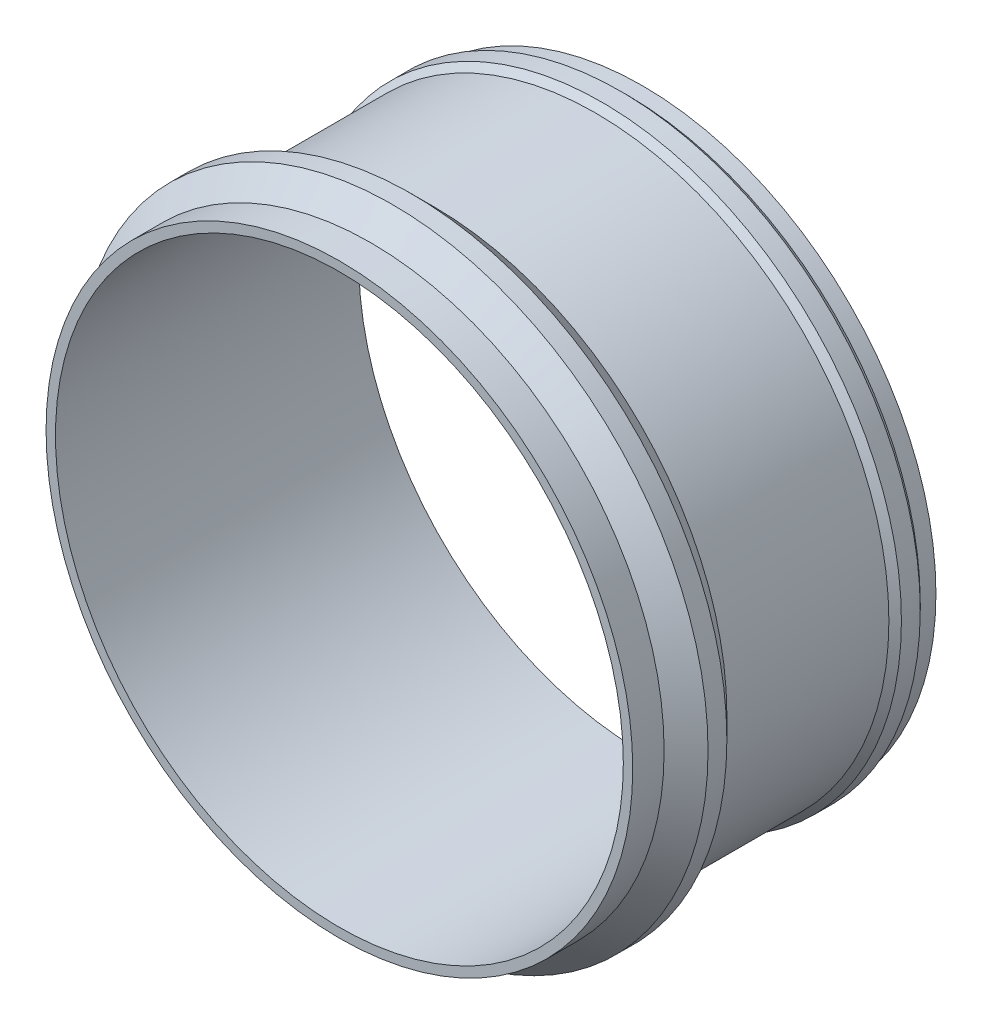
ISO-10303-21;
HEADER;
FILE_DESCRIPTION(('STEP AP214'),'2;1');
FILE_NAME('part.step','',(''),(''),'','','');
FILE_SCHEMA(('AUTOMOTIVE_DESIGN { 1 0 10303 214 1 1 1 1 }'));
ENDSEC;
DATA;
#1=APPLICATION_CONTEXT('core data for automotive mechanical design processes');
#2=APPLICATION_PROTOCOL_DEFINITION('international standard','automotive_design',2000,#1);
#3=PRODUCT_CONTEXT('',#1,'mechanical');
#4=PRODUCT('Part','Part','',(#3));
#5=PRODUCT_RELATED_PRODUCT_CATEGORY('part','',(#4));
#6=PRODUCT_DEFINITION_FORMATION('','',#4);
#7=PRODUCT_DEFINITION_CONTEXT('part definition',#1,'design');
#8=PRODUCT_DEFINITION('design','',#6,#7);
#9=PRODUCT_DEFINITION_SHAPE('','',#8);
#10=(LENGTH_UNIT() NAMED_UNIT(*) SI_UNIT(.MILLI.,.METRE.));
#11=(NAMED_UNIT(*) PLANE_ANGLE_UNIT() SI_UNIT($,.RADIAN.));
#12=(NAMED_UNIT(*) SI_UNIT($,.STERADIAN.) SOLID_ANGLE_UNIT());
#13=UNCERTAINTY_MEASURE_WITH_UNIT(LENGTH_MEASURE(1.E-05),#10,'distance_accuracy_value','');
#14=(GEOMETRIC_REPRESENTATION_CONTEXT(3) GLOBAL_UNCERTAINTY_ASSIGNED_CONTEXT((#13)) GLOBAL_UNIT_ASSIGNED_CONTEXT((#10,
#11,#12)) REPRESENTATION_CONTEXT('',''));
#15=CARTESIAN_POINT('',(0.,0.,0.));
#16=DIRECTION('',(0.,0.,1.));
#17=DIRECTION('',(1.,0.,0.));
#18=AXIS2_PLACEMENT_3D('',#15,#16,#17);
#19=CARTESIAN_POINT('',(0.,0.,0.));
#20=DIRECTION('',(0.,0.,1.));
#21=DIRECTION('',(1.,0.,0.));
#22=AXIS2_PLACEMENT_3D('',#19,#20,#21);
#23=CYLINDRICAL_SURFACE('',#22,90.5);
#24=CARTESIAN_POINT('',(0.,0.,-24.1067124122684));
#25=DIRECTION('',(0.,0.,1.));
#26=DIRECTION('',(1.,0.,0.));
#27=AXIS2_PLACEMENT_3D('',#24,#25,#26);
#28=CIRCLE('',#27,90.5);
#29=CARTESIAN_POINT('',(90.5,0.,-24.1067124122684));
#30=VERTEX_POINT('',#29);
#31=EDGE_CURVE('E10',#30,#30,#28,.T.);
#32=ORIENTED_EDGE('',*,*,#31,.T.);
#33=EDGE_LOOP('',(#32));
#34=FACE_BOUND('',#33,.T.);
#35=CARTESIAN_POINT('',(0.,0.,-120.746712412268));
#36=DIRECTION('',(0.,0.,1.));
#37=DIRECTION('',(1.,0.,0.));
#38=AXIS2_PLACEMENT_3D('',#35,#36,#37);
#39=CIRCLE('',#38,90.5);
#40=CARTESIAN_POINT('',(90.5,0.,-120.746712412268));
#41=VERTEX_POINT('',#40);
#42=EDGE_CURVE('E76',#41,#41,#39,.T.);
#43=ORIENTED_EDGE('',*,*,#42,.F.);
#44=EDGE_LOOP('',(#43));
#45=FACE_BOUND('',#44,.T.);
#46=ADVANCED_FACE('F36',(#34,#45),#23,.F.);
#47=CARTESIAN_POINT('',(90.5,0.,-24.1067124122684));
#48=DIRECTION('',(0.,0.,1.));
#49=DIRECTION('',(1.,0.,0.));
#50=AXIS2_PLACEMENT_3D('',#47,#48,#49);
#51=PLANE('',#50);
#52=CARTESIAN_POINT('',(0.,0.,-24.1067124122684));
#53=DIRECTION('',(0.,0.,1.));
#54=DIRECTION('',(1.,0.,0.));
#55=AXIS2_PLACEMENT_3D('',#52,#53,#54);
#56=CIRCLE('',#55,93.5);
#57=CARTESIAN_POINT('',(93.5,0.,-24.1067124122684));
#58=VERTEX_POINT('',#57);
#59=EDGE_CURVE('E42',#58,#58,#56,.T.);
#60=ORIENTED_EDGE('',*,*,#59,.T.);
#61=EDGE_LOOP('',(#60));
#62=FACE_BOUND('',#61,.T.);
#63=ORIENTED_EDGE('',*,*,#31,.F.);
#64=EDGE_LOOP('',(#63));
#65=FACE_BOUND('',#64,.T.);
#66=ADVANCED_FACE('F84',(#62,#65),#51,.T.);
#67=CARTESIAN_POINT('',(0.,0.,0.));
#68=DIRECTION('',(0.,0.,1.));
#69=DIRECTION('',(1.,0.,0.));
#70=AXIS2_PLACEMENT_3D('',#67,#68,#69);
#71=CYLINDRICAL_SURFACE('',#70,93.5);
#72=CARTESIAN_POINT('',(0.,0.,-34.1067124122684));
#73=DIRECTION('',(0.,0.,1.));
#74=DIRECTION('',(1.,0.,0.));
#75=AXIS2_PLACEMENT_3D('',#72,#73,#74);
#76=CIRCLE('',#75,93.5);
#77=CARTESIAN_POINT('',(93.5,0.,-34.1067124122684));
#78=VERTEX_POINT('',#77);
#79=EDGE_CURVE('E46',#78,#78,#76,.T.);
#80=ORIENTED_EDGE('',*,*,#79,.T.);
#81=EDGE_LOOP('',(#80));
#82=FACE_BOUND('',#81,.T.);
#83=ORIENTED_EDGE('',*,*,#59,.F.);
#84=EDGE_LOOP('',(#83));
#85=FACE_BOUND('',#84,.T.);
#86=ADVANCED_FACE('F88',(#82,#85),#71,.T.);
#87=CARTESIAN_POINT('',(0.,0.,-34.1067124122684));
#88=DIRECTION('',(0.,0.,-1.));
#89=DIRECTION('',(-1.,0.,0.));
#90=AXIS2_PLACEMENT_3D('',#87,#88,#89);
#91=CONICAL_SURFACE('',#90,93.5,0.785398163397452);
#92=CARTESIAN_POINT('',(0.,0.,-41.1067124122683));
#93=DIRECTION('',(0.,0.,1.));
#94=DIRECTION('',(1.,0.,0.));
#95=AXIS2_PLACEMENT_3D('',#92,#93,#94);
#96=CIRCLE('',#95,100.5);
#97=CARTESIAN_POINT('',(100.5,0.,-41.1067124122683));
#98=VERTEX_POINT('',#97);
#99=EDGE_CURVE('E50',#98,#98,#96,.T.);
#100=ORIENTED_EDGE('',*,*,#99,.T.);
#101=EDGE_LOOP('',(#100));
#102=FACE_BOUND('',#101,.T.);
#103=ORIENTED_EDGE('',*,*,#79,.F.);
#104=EDGE_LOOP('',(#103));
#105=FACE_BOUND('',#104,.T.);
#106=ADVANCED_FACE('F92',(#102,#105),#91,.T.);
#107=CARTESIAN_POINT('',(0.,0.,0.));
#108=DIRECTION('',(0.,0.,1.));
#109=DIRECTION('',(1.,0.,0.));
#110=AXIS2_PLACEMENT_3D('',#107,#108,#109);
#111=CYLINDRICAL_SURFACE('',#110,100.5);
#112=CARTESIAN_POINT('',(0.,0.,-47.1067124122685));
#113=DIRECTION('',(0.,0.,1.));
#114=DIRECTION('',(1.,0.,0.));
#115=AXIS2_PLACEMENT_3D('',#112,#113,#114);
#116=CIRCLE('',#115,100.5);
#117=CARTESIAN_POINT('',(100.5,0.,-47.1067124122685));
#118=VERTEX_POINT('',#117);
#119=EDGE_CURVE('E55',#118,#118,#116,.T.);
#120=ORIENTED_EDGE('',*,*,#119,.T.);
#121=EDGE_LOOP('',(#120));
#122=FACE_BOUND('',#121,.T.);
#123=ORIENTED_EDGE('',*,*,#99,.F.);
#124=EDGE_LOOP('',(#123));
#125=FACE_BOUND('',#124,.T.);
#126=ADVANCED_FACE('F99',(#122,#125),#111,.T.);
#127=CARTESIAN_POINT('',(0.,0.,-47.1067124122685));
#128=DIRECTION('',(0.,0.,1.));
#129=DIRECTION('',(1.,0.,0.));
#130=AXIS2_PLACEMENT_3D('',#127,#128,#129);
#131=CONICAL_SURFACE('',#130,100.5,0.785398163397453);
#132=CARTESIAN_POINT('',(0.,0.,-54.1067124122684));
#133=DIRECTION('',(0.,0.,1.));
#134=DIRECTION('',(1.,0.,0.));
#135=AXIS2_PLACEMENT_3D('',#132,#133,#134);
#136=CIRCLE('',#135,93.5);
#137=CARTESIAN_POINT('',(93.5,0.,-54.1067124122684));
#138=VERTEX_POINT('',#137);
#139=EDGE_CURVE('E58',#138,#138,#136,.T.);
#140=ORIENTED_EDGE('',*,*,#139,.T.);
#141=EDGE_LOOP('',(#140));
#142=FACE_BOUND('',#141,.T.);
#143=ORIENTED_EDGE('',*,*,#119,.F.);
#144=EDGE_LOOP('',(#143));
#145=FACE_BOUND('',#144,.T.);
#146=ADVANCED_FACE('F103',(#142,#145),#131,.T.);
#147=CARTESIAN_POINT('',(0.,0.,0.));
#148=DIRECTION('',(0.,0.,1.));
#149=DIRECTION('',(1.,0.,0.));
#150=AXIS2_PLACEMENT_3D('',#147,#148,#149);
#151=CYLINDRICAL_SURFACE('',#150,93.5);
#152=CARTESIAN_POINT('',(0.,0.,-105.746712412268));
#153=DIRECTION('',(0.,0.,1.));
#154=DIRECTION('',(1.,0.,0.));
#155=AXIS2_PLACEMENT_3D('',#152,#153,#154);
#156=CIRCLE('',#155,93.5);
#157=CARTESIAN_POINT('',(93.5,0.,-105.746712412268));
#158=VERTEX_POINT('',#157);
#159=EDGE_CURVE('E61',#158,#158,#156,.T.);
#160=ORIENTED_EDGE('',*,*,#159,.T.);
#161=EDGE_LOOP('',(#160));
#162=FACE_BOUND('',#161,.T.);
#163=ORIENTED_EDGE('',*,*,#139,.F.);
#164=EDGE_LOOP('',(#163));
#165=FACE_BOUND('',#164,.T.);
#166=ADVANCED_FACE('F107',(#162,#165),#151,.T.);
#167=CARTESIAN_POINT('',(0.,0.,-105.746712412268));
#168=DIRECTION('',(0.,0.,-1.));
#169=DIRECTION('',(-1.,0.,0.));
#170=AXIS2_PLACEMENT_3D('',#167,#168,#169);
#171=CONICAL_SURFACE('',#170,93.5,0.785398163397455);
#172=CARTESIAN_POINT('',(0.,0.,-107.746712412268));
#173=DIRECTION('',(0.,0.,1.));
#174=DIRECTION('',(1.,0.,0.));
#175=AXIS2_PLACEMENT_3D('',#172,#173,#174);
#176=CIRCLE('',#175,95.5);
#177=CARTESIAN_POINT('',(95.5,0.,-107.746712412268));
#178=VERTEX_POINT('',#177);
#179=EDGE_CURVE('E64',#178,#178,#176,.T.);
#180=ORIENTED_EDGE('',*,*,#179,.T.);
#181=EDGE_LOOP('',(#180));
#182=FACE_BOUND('',#181,.T.);
#183=ORIENTED_EDGE('',*,*,#159,.F.);
#184=EDGE_LOOP('',(#183));
#185=FACE_BOUND('',#184,.T.);
#186=ADVANCED_FACE('F111',(#182,#185),#171,.T.);
#187=CARTESIAN_POINT('',(0.,0.,0.));
#188=DIRECTION('',(0.,0.,1.));
#189=DIRECTION('',(1.,0.,0.));
#190=AXIS2_PLACEMENT_3D('',#187,#188,#189);
#191=CYLINDRICAL_SURFACE('',#190,95.5);
#192=CARTESIAN_POINT('',(0.,0.,-113.746712412268));
#193=DIRECTION('',(0.,0.,1.));
#194=DIRECTION('',(1.,0.,0.));
#195=AXIS2_PLACEMENT_3D('',#192,#193,#194);
#196=CIRCLE('',#195,95.5);
#197=CARTESIAN_POINT('',(95.5,0.,-113.746712412268));
#198=VERTEX_POINT('',#197);
#199=EDGE_CURVE('E67',#198,#198,#196,.T.);
#200=ORIENTED_EDGE('',*,*,#199,.T.);
#201=EDGE_LOOP('',(#200));
#202=FACE_BOUND('',#201,.T.);
#203=ORIENTED_EDGE('',*,*,#179,.F.);
#204=EDGE_LOOP('',(#203));
#205=FACE_BOUND('',#204,.T.);
#206=ADVANCED_FACE('F115',(#202,#205),#191,.T.);
#207=CARTESIAN_POINT('',(0.,0.,-113.746712412268));
#208=DIRECTION('',(0.,0.,1.));
#209=DIRECTION('',(1.,0.,0.));
#210=AXIS2_PLACEMENT_3D('',#207,#208,#209);
#211=CONICAL_SURFACE('',#210,95.5,0.785398163397448);
#212=CARTESIAN_POINT('',(0.,0.,-115.746712412268));
#213=DIRECTION('',(0.,0.,1.));
#214=DIRECTION('',(1.,0.,0.));
#215=AXIS2_PLACEMENT_3D('',#212,#213,#214);
#216=CIRCLE('',#215,93.5);
#217=CARTESIAN_POINT('',(93.5,0.,-115.746712412268));
#218=VERTEX_POINT('',#217);
#219=EDGE_CURVE('E70',#218,#218,#216,.T.);
#220=ORIENTED_EDGE('',*,*,#219,.T.);
#221=EDGE_LOOP('',(#220));
#222=FACE_BOUND('',#221,.T.);
#223=ORIENTED_EDGE('',*,*,#199,.F.);
#224=EDGE_LOOP('',(#223));
#225=FACE_BOUND('',#224,.T.);
#226=ADVANCED_FACE('F119',(#222,#225),#211,.T.);
#227=CARTESIAN_POINT('',(0.,0.,0.));
#228=DIRECTION('',(0.,0.,1.));
#229=DIRECTION('',(1.,0.,0.));
#230=AXIS2_PLACEMENT_3D('',#227,#228,#229);
#231=CYLINDRICAL_SURFACE('',#230,93.5);
#232=CARTESIAN_POINT('',(0.,0.,-120.746712412268));
#233=DIRECTION('',(0.,0.,1.));
#234=DIRECTION('',(1.,0.,0.));
#235=AXIS2_PLACEMENT_3D('',#232,#233,#234);
#236=CIRCLE('',#235,93.5);
#237=CARTESIAN_POINT('',(93.5,0.,-120.746712412268));
#238=VERTEX_POINT('',#237);
#239=EDGE_CURVE('E73',#238,#238,#236,.T.);
#240=ORIENTED_EDGE('',*,*,#239,.T.);
#241=EDGE_LOOP('',(#240));
#242=FACE_BOUND('',#241,.T.);
#243=ORIENTED_EDGE('',*,*,#219,.F.);
#244=EDGE_LOOP('',(#243));
#245=FACE_BOUND('',#244,.T.);
#246=ADVANCED_FACE('F123',(#242,#245),#231,.T.);
#247=CARTESIAN_POINT('',(90.5,0.,-120.746712412268));
#248=DIRECTION('',(0.,0.,-1.));
#249=DIRECTION('',(-1.,0.,0.));
#250=AXIS2_PLACEMENT_3D('',#247,#248,#249);
#251=PLANE('',#250);
#252=ORIENTED_EDGE('',*,*,#42,.T.);
#253=EDGE_LOOP('',(#252));
#254=FACE_BOUND('',#253,.T.);
#255=ORIENTED_EDGE('',*,*,#239,.F.);
#256=EDGE_LOOP('',(#255));
#257=FACE_BOUND('',#256,.T.);
#258=ADVANCED_FACE('F80',(#254,#257),#251,.T.);
#259=CLOSED_SHELL('',(#46,#66,#86,#106,#126,#146,#166,#186,#206,#226,#246,#258));
#260=MANIFOLD_SOLID_BREP('B2',#259);
#261=ADVANCED_BREP_SHAPE_REPRESENTATION('',(#18,#260),#14);
#262=SHAPE_DEFINITION_REPRESENTATION(#9,#261);
ENDSEC;
END-ISO-10303-21;
